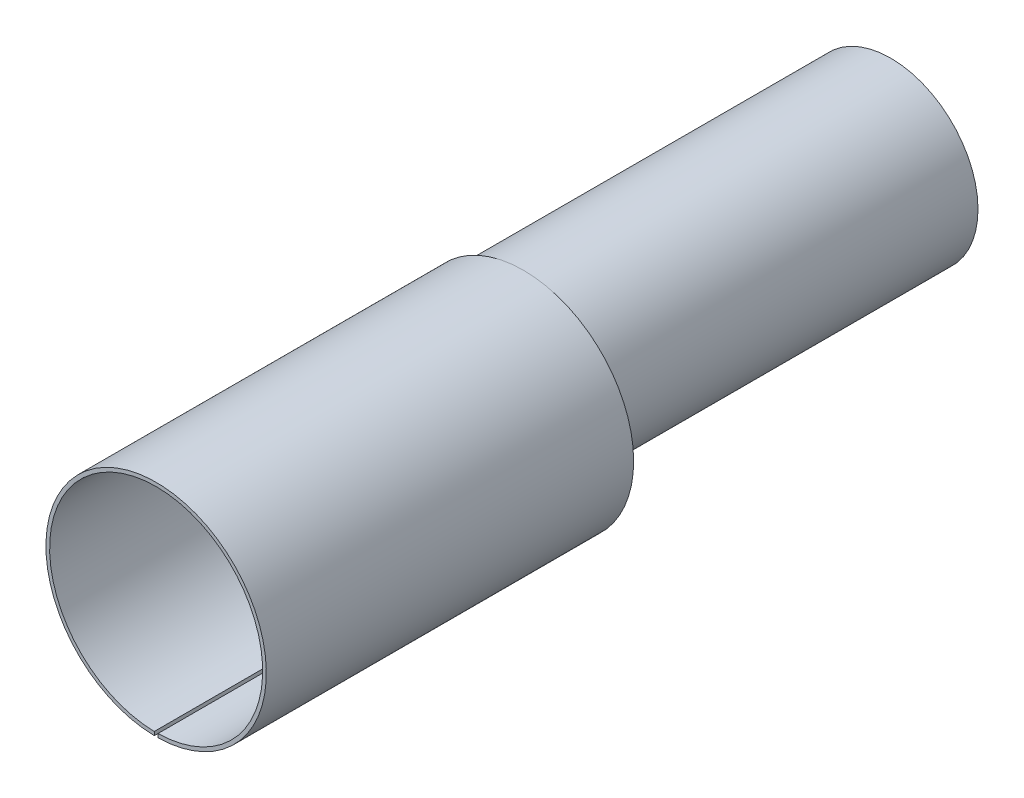
ISO-10303-21;
HEADER;
FILE_DESCRIPTION(('STEP AP214'),'2;1');
FILE_NAME('part.step','',(''),(''),'','','');
FILE_SCHEMA(('AUTOMOTIVE_DESIGN { 1 0 10303 214 1 1 1 1 }'));
ENDSEC;
DATA;
#1=APPLICATION_CONTEXT('core data for automotive mechanical design processes');
#2=APPLICATION_PROTOCOL_DEFINITION('international standard','automotive_design',2000,#1);
#3=PRODUCT_CONTEXT('',#1,'mechanical');
#4=PRODUCT('Part','Part','',(#3));
#5=PRODUCT_RELATED_PRODUCT_CATEGORY('part','',(#4));
#6=PRODUCT_DEFINITION_FORMATION('','',#4);
#7=PRODUCT_DEFINITION_CONTEXT('part definition',#1,'design');
#8=PRODUCT_DEFINITION('design','',#6,#7);
#9=PRODUCT_DEFINITION_SHAPE('','',#8);
#10=(LENGTH_UNIT() NAMED_UNIT(*) SI_UNIT(.MILLI.,.METRE.));
#11=(NAMED_UNIT(*) PLANE_ANGLE_UNIT() SI_UNIT($,.RADIAN.));
#12=(NAMED_UNIT(*) SI_UNIT($,.STERADIAN.) SOLID_ANGLE_UNIT());
#13=UNCERTAINTY_MEASURE_WITH_UNIT(LENGTH_MEASURE(1.E-05),#10,'distance_accuracy_value','');
#14=(GEOMETRIC_REPRESENTATION_CONTEXT(3) GLOBAL_UNCERTAINTY_ASSIGNED_CONTEXT((#13)) GLOBAL_UNIT_ASSIGNED_CONTEXT((#10,
#11,#12)) REPRESENTATION_CONTEXT('',''));
#15=CARTESIAN_POINT('',(0.,0.,0.));
#16=DIRECTION('',(0.,0.,1.));
#17=DIRECTION('',(1.,0.,0.));
#18=AXIS2_PLACEMENT_3D('',#15,#16,#17);
#19=CARTESIAN_POINT('',(0.,0.,20.));
#20=DIRECTION('',(0.,0.,1.));
#21=DIRECTION('',(1.,0.,0.));
#22=AXIS2_PLACEMENT_3D('',#19,#20,#21);
#23=PLANE('',#22);
#24=CARTESIAN_POINT('',(0.,0.,20.));
#25=DIRECTION('',(0.,0.,1.));
#26=DIRECTION('',(1.,0.,0.));
#27=AXIS2_PLACEMENT_3D('',#24,#25,#26);
#28=CIRCLE('',#27,6.);
#29=CARTESIAN_POINT('',(0.1,-5.99916660878826,20.));
#30=VERTEX_POINT('',#29);
#31=CARTESIAN_POINT('',(-0.1,-5.99916660878826,20.));
#32=VERTEX_POINT('',#31);
#33=EDGE_CURVE('E155',#30,#32,#28,.T.);
#34=ORIENTED_EDGE('',*,*,#33,.T.);
#35=DIRECTION('',(0.,-1.,0.));
#36=VECTOR('',#35,1.);
#37=CARTESIAN_POINT('',(-0.1,-0.813533081863814,20.));
#38=LINE('',#37,#36);
#39=CARTESIAN_POINT('',(-0.1,-5.7991378669592,20.));
#40=VERTEX_POINT('',#39);
#41=EDGE_CURVE('E118',#40,#32,#38,.T.);
#42=ORIENTED_EDGE('',*,*,#41,.F.);
#43=CARTESIAN_POINT('',(0.,0.,20.));
#44=DIRECTION('',(0.,0.,1.));
#45=DIRECTION('',(1.,0.,0.));
#46=AXIS2_PLACEMENT_3D('',#43,#44,#45);
#47=CIRCLE('',#46,5.8);
#48=CARTESIAN_POINT('',(0.1,-5.7991378669592,20.));
#49=VERTEX_POINT('',#48);
#50=EDGE_CURVE('E149',#49,#40,#47,.T.);
#51=ORIENTED_EDGE('',*,*,#50,.F.);
#52=DIRECTION('',(0.,1.,0.));
#53=VECTOR('',#52,1.);
#54=CARTESIAN_POINT('',(0.1,-0.813533081863814,20.));
#55=LINE('',#54,#53);
#56=EDGE_CURVE('E56',#30,#49,#55,.T.);
#57=ORIENTED_EDGE('',*,*,#56,.F.);
#58=EDGE_LOOP('',(#34,#42,#51,#57));
#59=FACE_BOUND('',#58,.T.);
#60=ADVANCED_FACE('F33',(#59),#23,.T.);
#61=CARTESIAN_POINT('',(0.,0.,0.));
#62=DIRECTION('',(0.,0.,1.));
#63=DIRECTION('',(1.,0.,0.));
#64=AXIS2_PLACEMENT_3D('',#61,#62,#63);
#65=PLANE('',#64);
#66=DIRECTION('',(0.,1.,0.));
#67=VECTOR('',#66,1.);
#68=CARTESIAN_POINT('',(-0.1,0.,0.));
#69=LINE('',#68,#67);
#70=CARTESIAN_POINT('',(-0.1,-5.99916660878826,0.));
#71=VERTEX_POINT('',#70);
#72=CARTESIAN_POINT('',(-0.1,-5.79913786695919,0.));
#73=VERTEX_POINT('',#72);
#74=EDGE_CURVE('E48',#71,#73,#69,.T.);
#75=ORIENTED_EDGE('',*,*,#74,.F.);
#76=CARTESIAN_POINT('',(0.,0.,0.));
#77=DIRECTION('',(0.,0.,1.));
#78=DIRECTION('',(1.,0.,0.));
#79=AXIS2_PLACEMENT_3D('',#76,#77,#78);
#80=CIRCLE('',#79,6.);
#81=CARTESIAN_POINT('',(0.,6.,0.));
#82=VERTEX_POINT('',#81);
#83=EDGE_CURVE('E158',#82,#71,#80,.T.);
#84=ORIENTED_EDGE('',*,*,#83,.F.);
#85=CARTESIAN_POINT('',(0.,1.25,0.));
#86=DIRECTION('',(0.,0.,1.));
#87=DIRECTION('',(1.,0.,0.));
#88=AXIS2_PLACEMENT_3D('',#85,#86,#87);
#89=CIRCLE('',#88,4.75);
#90=CARTESIAN_POINT('',(-2.84198240670134,5.05600000000001,0.));
#91=VERTEX_POINT('',#90);
#92=EDGE_CURVE('E144',#82,#91,#89,.T.);
#93=ORIENTED_EDGE('',*,*,#92,.T.);
#94=CARTESIAN_POINT('',(0.,0.,0.));
#95=DIRECTION('',(0.,0.,1.));
#96=DIRECTION('',(1.,0.,0.));
#97=AXIS2_PLACEMENT_3D('',#94,#95,#96);
#98=CIRCLE('',#97,5.8);
#99=EDGE_CURVE('E138',#91,#73,#98,.T.);
#100=ORIENTED_EDGE('',*,*,#99,.T.);
#101=EDGE_LOOP('',(#75,#84,#93,#100));
#102=FACE_BOUND('',#101,.T.);
#103=ADVANCED_FACE('F212',(#102),#65,.F.);
#104=DIRECTION('',(0.,-1.,0.));
#105=VECTOR('',#104,1.);
#106=CARTESIAN_POINT('',(0.1,0.,0.));
#107=LINE('',#106,#105);
#108=CARTESIAN_POINT('',(0.1,-5.7991378669592,0.));
#109=VERTEX_POINT('',#108);
#110=CARTESIAN_POINT('',(0.1,-5.99916660878826,0.));
#111=VERTEX_POINT('',#110);
#112=EDGE_CURVE('E186',#109,#111,#107,.T.);
#113=ORIENTED_EDGE('',*,*,#112,.F.);
#114=CARTESIAN_POINT('',(2.84198240670135,5.05600000000001,0.));
#115=VERTEX_POINT('',#114);
#116=EDGE_CURVE('E135',#109,#115,#98,.T.);
#117=ORIENTED_EDGE('',*,*,#116,.T.);
#118=EDGE_CURVE('E136',#115,#82,#89,.T.);
#119=ORIENTED_EDGE('',*,*,#118,.T.);
#120=EDGE_CURVE('E151',#111,#82,#80,.T.);
#121=ORIENTED_EDGE('',*,*,#120,.F.);
#122=EDGE_LOOP('',(#113,#117,#119,#121));
#123=FACE_BOUND('',#122,.T.);
#124=ADVANCED_FACE('F208',(#123),#65,.F.);
#125=CARTESIAN_POINT('',(0.,0.,20.));
#126=DIRECTION('',(0.,0.,-1.));
#127=DIRECTION('',(-1.,0.,0.));
#128=AXIS2_PLACEMENT_3D('',#125,#126,#127);
#129=CYLINDRICAL_SURFACE('',#128,6.);
#130=DIRECTION('',(0.,0.,-1.));
#131=VECTOR('',#130,1.);
#132=CARTESIAN_POINT('',(-0.1,-5.99916660878826,20.));
#133=LINE('',#132,#131);
#134=EDGE_CURVE('E175',#32,#71,#133,.T.);
#135=ORIENTED_EDGE('',*,*,#134,.F.);
#136=ORIENTED_EDGE('',*,*,#33,.F.);
#137=DIRECTION('',(0.,0.,-1.));
#138=VECTOR('',#137,1.);
#139=CARTESIAN_POINT('',(0.1,-5.99916660878826,20.));
#140=LINE('',#139,#138);
#141=EDGE_CURVE('E184',#111,#30,#140,.F.);
#142=ORIENTED_EDGE('',*,*,#141,.F.);
#143=ORIENTED_EDGE('',*,*,#120,.T.);
#144=ORIENTED_EDGE('',*,*,#83,.T.);
#145=EDGE_LOOP('',(#135,#136,#142,#143,#144));
#146=FACE_BOUND('',#145,.T.);
#147=ADVANCED_FACE('F35',(#146),#129,.T.);
#148=CARTESIAN_POINT('',(0.,0.,20.));
#149=DIRECTION('',(0.,0.,-1.));
#150=DIRECTION('',(-1.,0.,0.));
#151=AXIS2_PLACEMENT_3D('',#148,#149,#150);
#152=CYLINDRICAL_SURFACE('',#151,5.8);
#153=ORIENTED_EDGE('',*,*,#50,.T.);
#154=DIRECTION('',(0.,0.,-1.));
#155=VECTOR('',#154,1.);
#156=CARTESIAN_POINT('',(-0.1,-5.7991378669592,20.));
#157=LINE('',#156,#155);
#158=EDGE_CURVE('E178',#40,#73,#157,.T.);
#159=ORIENTED_EDGE('',*,*,#158,.T.);
#160=ORIENTED_EDGE('',*,*,#99,.F.);
#161=CARTESIAN_POINT('',(0.,5.8,0.));
#162=VERTEX_POINT('',#161);
#163=EDGE_CURVE('E154',#162,#91,#98,.T.);
#164=ORIENTED_EDGE('',*,*,#163,.F.);
#165=EDGE_CURVE('E140',#115,#162,#98,.T.);
#166=ORIENTED_EDGE('',*,*,#165,.F.);
#167=ORIENTED_EDGE('',*,*,#116,.F.);
#168=DIRECTION('',(0.,0.,-1.));
#169=VECTOR('',#168,1.);
#170=CARTESIAN_POINT('',(0.1,-5.7991378669592,20.));
#171=LINE('',#170,#169);
#172=EDGE_CURVE('E130',#109,#49,#171,.F.);
#173=ORIENTED_EDGE('',*,*,#172,.T.);
#174=EDGE_LOOP('',(#153,#159,#160,#164,#166,#167,#173));
#175=FACE_BOUND('',#174,.T.);
#176=ADVANCED_FACE('F201',(#175),#152,.F.);
#177=CARTESIAN_POINT('',(0.,1.25,-20.));
#178=DIRECTION('',(0.,0.,1.));
#179=DIRECTION('',(1.,0.,0.));
#180=AXIS2_PLACEMENT_3D('',#177,#178,#179);
#181=CYLINDRICAL_SURFACE('',#180,4.75);
#182=CARTESIAN_POINT('',(0.,1.25,-20.));
#183=DIRECTION('',(0.,0.,1.));
#184=DIRECTION('',(1.,0.,0.));
#185=AXIS2_PLACEMENT_3D('',#182,#183,#184);
#186=CIRCLE('',#185,4.75);
#187=CARTESIAN_POINT('',(0.1,-3.49894725176012,-20.));
#188=VERTEX_POINT('',#187);
#189=CARTESIAN_POINT('',(-0.1,-3.49894725176012,-20.));
#190=VERTEX_POINT('',#189);
#191=EDGE_CURVE('E126',#188,#190,#186,.T.);
#192=ORIENTED_EDGE('',*,*,#191,.T.);
#193=DIRECTION('',(0.,0.,1.));
#194=VECTOR('',#193,1.);
#195=CARTESIAN_POINT('',(-0.1,-3.49894725176012,-20.));
#196=LINE('',#195,#194);
#197=CARTESIAN_POINT('',(-0.1,-3.49894725176012,0.));
#198=VERTEX_POINT('',#197);
#199=EDGE_CURVE('E180',#190,#198,#196,.T.);
#200=ORIENTED_EDGE('',*,*,#199,.T.);
#201=EDGE_CURVE('E142',#91,#198,#89,.T.);
#202=ORIENTED_EDGE('',*,*,#201,.F.);
#203=ORIENTED_EDGE('',*,*,#92,.F.);
#204=ORIENTED_EDGE('',*,*,#118,.F.);
#205=CARTESIAN_POINT('',(0.1,-3.49894725176012,0.));
#206=VERTEX_POINT('',#205);
#207=EDGE_CURVE('E129',#206,#115,#89,.T.);
#208=ORIENTED_EDGE('',*,*,#207,.F.);
#209=DIRECTION('',(0.,0.,1.));
#210=VECTOR('',#209,1.);
#211=CARTESIAN_POINT('',(0.1,-3.49894725176012,-20.));
#212=LINE('',#211,#210);
#213=EDGE_CURVE('E111',#206,#188,#212,.F.);
#214=ORIENTED_EDGE('',*,*,#213,.T.);
#215=EDGE_LOOP('',(#192,#200,#202,#203,#204,#208,#214));
#216=FACE_BOUND('',#215,.T.);
#217=ADVANCED_FACE('F124',(#216),#181,.T.);
#218=CARTESIAN_POINT('',(0.,1.25,-20.));
#219=DIRECTION('',(0.,0.,1.));
#220=DIRECTION('',(1.,0.,0.));
#221=AXIS2_PLACEMENT_3D('',#218,#219,#220);
#222=PLANE('',#221);
#223=DIRECTION('',(0.,-1.,0.));
#224=VECTOR('',#223,1.);
#225=CARTESIAN_POINT('',(-0.1,-0.813533081863814,-20.));
#226=LINE('',#225,#224);
#227=CARTESIAN_POINT('',(-0.1,-3.29890096616754,-20.));
#228=VERTEX_POINT('',#227);
#229=EDGE_CURVE('E119',#228,#190,#226,.T.);
#230=ORIENTED_EDGE('',*,*,#229,.T.);
#231=ORIENTED_EDGE('',*,*,#191,.F.);
#232=DIRECTION('',(0.,1.,0.));
#233=VECTOR('',#232,1.);
#234=CARTESIAN_POINT('',(0.1,-0.813533081863814,-20.));
#235=LINE('',#234,#233);
#236=CARTESIAN_POINT('',(0.1,-3.29890096616754,-20.));
#237=VERTEX_POINT('',#236);
#238=EDGE_CURVE('E108',#188,#237,#235,.T.);
#239=ORIENTED_EDGE('',*,*,#238,.T.);
#240=CARTESIAN_POINT('',(0.,1.25,-20.));
#241=DIRECTION('',(0.,0.,1.));
#242=DIRECTION('',(1.,0.,0.));
#243=AXIS2_PLACEMENT_3D('',#240,#241,#242);
#244=CIRCLE('',#243,4.55);
#245=EDGE_CURVE('E170',#237,#228,#244,.T.);
#246=ORIENTED_EDGE('',*,*,#245,.T.);
#247=EDGE_LOOP('',(#230,#231,#239,#246));
#248=FACE_BOUND('',#247,.T.);
#249=ADVANCED_FACE('F134',(#248),#222,.F.);
#250=CARTESIAN_POINT('',(0.,1.25,0.));
#251=DIRECTION('',(0.,0.,1.));
#252=DIRECTION('',(1.,0.,0.));
#253=AXIS2_PLACEMENT_3D('',#250,#251,#252);
#254=PLANE('',#253);
#255=ORIENTED_EDGE('',*,*,#201,.T.);
#256=DIRECTION('',(0.,1.,0.));
#257=VECTOR('',#256,1.);
#258=CARTESIAN_POINT('',(-0.1,1.25,0.));
#259=LINE('',#258,#257);
#260=CARTESIAN_POINT('',(-0.1,-3.29890096616754,0.));
#261=VERTEX_POINT('',#260);
#262=EDGE_CURVE('E182',#198,#261,#259,.T.);
#263=ORIENTED_EDGE('',*,*,#262,.T.);
#264=CARTESIAN_POINT('',(0.,1.25,0.));
#265=DIRECTION('',(0.,0.,1.));
#266=DIRECTION('',(1.,0.,0.));
#267=AXIS2_PLACEMENT_3D('',#264,#265,#266);
#268=CIRCLE('',#267,4.55);
#269=EDGE_CURVE('E146',#162,#261,#268,.T.);
#270=ORIENTED_EDGE('',*,*,#269,.F.);
#271=ORIENTED_EDGE('',*,*,#163,.T.);
#272=EDGE_LOOP('',(#255,#263,#270,#271));
#273=FACE_BOUND('',#272,.T.);
#274=ADVANCED_FACE('F211',(#273),#254,.T.);
#275=CARTESIAN_POINT('',(0.1,-3.29890096616754,0.));
#276=VERTEX_POINT('',#275);
#277=EDGE_CURVE('E173',#276,#162,#268,.T.);
#278=ORIENTED_EDGE('',*,*,#277,.F.);
#279=DIRECTION('',(0.,-1.,0.));
#280=VECTOR('',#279,1.);
#281=CARTESIAN_POINT('',(0.1,1.25,0.));
#282=LINE('',#281,#280);
#283=EDGE_CURVE('E131',#276,#206,#282,.T.);
#284=ORIENTED_EDGE('',*,*,#283,.T.);
#285=ORIENTED_EDGE('',*,*,#207,.T.);
#286=ORIENTED_EDGE('',*,*,#165,.T.);
#287=EDGE_LOOP('',(#278,#284,#285,#286));
#288=FACE_BOUND('',#287,.T.);
#289=ADVANCED_FACE('F226',(#288),#254,.T.);
#290=CARTESIAN_POINT('',(0.,1.25,-20.));
#291=DIRECTION('',(0.,0.,1.));
#292=DIRECTION('',(1.,0.,0.));
#293=AXIS2_PLACEMENT_3D('',#290,#291,#292);
#294=CYLINDRICAL_SURFACE('',#293,4.55);
#295=DIRECTION('',(0.,0.,1.));
#296=VECTOR('',#295,1.);
#297=CARTESIAN_POINT('',(-0.1,-3.29890096616754,-20.));
#298=LINE('',#297,#296);
#299=EDGE_CURVE('E11',#228,#261,#298,.T.);
#300=ORIENTED_EDGE('',*,*,#299,.F.);
#301=ORIENTED_EDGE('',*,*,#245,.F.);
#302=DIRECTION('',(0.,0.,1.));
#303=VECTOR('',#302,1.);
#304=CARTESIAN_POINT('',(0.1,-3.29890096616754,-20.));
#305=LINE('',#304,#303);
#306=EDGE_CURVE('E41',#276,#237,#305,.F.);
#307=ORIENTED_EDGE('',*,*,#306,.F.);
#308=ORIENTED_EDGE('',*,*,#277,.T.);
#309=ORIENTED_EDGE('',*,*,#269,.T.);
#310=EDGE_LOOP('',(#300,#301,#307,#308,#309));
#311=FACE_BOUND('',#310,.T.);
#312=ADVANCED_FACE('F229',(#311),#294,.F.);
#313=CARTESIAN_POINT('',(0.1,-0.813533081863814,20.));
#314=DIRECTION('',(-1.,0.,0.));
#315=DIRECTION('',(0.,0.,1.));
#316=AXIS2_PLACEMENT_3D('',#313,#314,#315);
#317=PLANE('',#316);
#318=ORIENTED_EDGE('',*,*,#283,.F.);
#319=ORIENTED_EDGE('',*,*,#306,.T.);
#320=ORIENTED_EDGE('',*,*,#238,.F.);
#321=ORIENTED_EDGE('',*,*,#213,.F.);
#322=EDGE_LOOP('',(#318,#319,#320,#321));
#323=FACE_BOUND('',#322,.T.);
#324=ADVANCED_FACE('F110',(#323),#317,.T.);
#325=CARTESIAN_POINT('',(-0.1,-0.813533081863814,20.));
#326=DIRECTION('',(1.,0.,0.));
#327=DIRECTION('',(0.,0.,-1.));
#328=AXIS2_PLACEMENT_3D('',#325,#326,#327);
#329=PLANE('',#328);
#330=ORIENTED_EDGE('',*,*,#229,.F.);
#331=ORIENTED_EDGE('',*,*,#299,.T.);
#332=ORIENTED_EDGE('',*,*,#262,.F.);
#333=ORIENTED_EDGE('',*,*,#199,.F.);
#334=EDGE_LOOP('',(#330,#331,#332,#333));
#335=FACE_BOUND('',#334,.T.);
#336=ADVANCED_FACE('F233',(#335),#329,.T.);
#337=ORIENTED_EDGE('',*,*,#141,.T.);
#338=ORIENTED_EDGE('',*,*,#56,.T.);
#339=ORIENTED_EDGE('',*,*,#172,.F.);
#340=ORIENTED_EDGE('',*,*,#112,.T.);
#341=EDGE_LOOP('',(#337,#338,#339,#340));
#342=FACE_BOUND('',#341,.T.);
#343=ADVANCED_FACE('F205',(#342),#317,.T.);
#344=ORIENTED_EDGE('',*,*,#134,.T.);
#345=ORIENTED_EDGE('',*,*,#74,.T.);
#346=ORIENTED_EDGE('',*,*,#158,.F.);
#347=ORIENTED_EDGE('',*,*,#41,.T.);
#348=EDGE_LOOP('',(#344,#345,#346,#347));
#349=FACE_BOUND('',#348,.T.);
#350=ADVANCED_FACE('F194',(#349),#329,.T.);
#351=CLOSED_SHELL('',(#60,#103,#124,#147,#176,#217,#249,#274,#289,#312,#324,#336,#343,#350));
#352=MANIFOLD_SOLID_BREP('B2',#351);
#353=ADVANCED_BREP_SHAPE_REPRESENTATION('',(#18,#352),#14);
#354=SHAPE_DEFINITION_REPRESENTATION(#9,#353);
ENDSEC;
END-ISO-10303-21;
